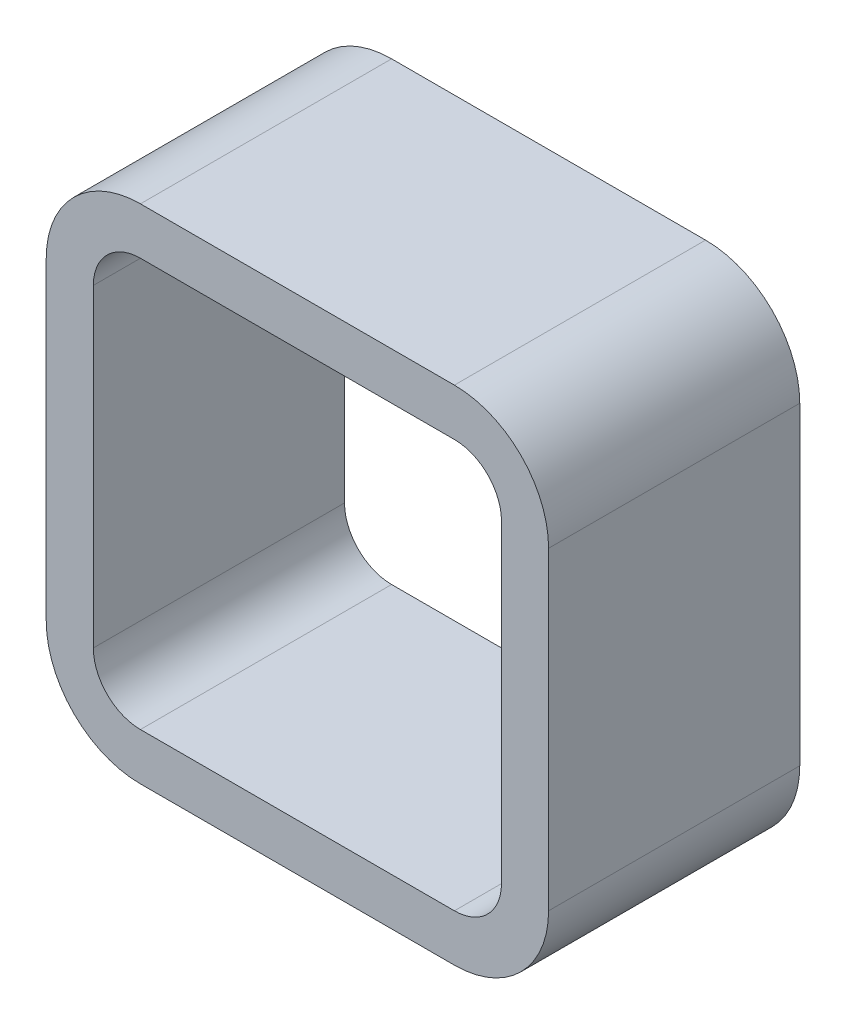
ISO-10303-21;
HEADER;
FILE_DESCRIPTION(('STEP AP214'),'2;1');
FILE_NAME('part.step','',(''),(''),'','','');
FILE_SCHEMA(('AUTOMOTIVE_DESIGN { 1 0 10303 214 1 1 1 1 }'));
ENDSEC;
DATA;
#1=APPLICATION_CONTEXT('core data for automotive mechanical design processes');
#2=APPLICATION_PROTOCOL_DEFINITION('international standard','automotive_design',2000,#1);
#3=PRODUCT_CONTEXT('',#1,'mechanical');
#4=PRODUCT('Part','Part','',(#3));
#5=PRODUCT_RELATED_PRODUCT_CATEGORY('part','',(#4));
#6=PRODUCT_DEFINITION_FORMATION('','',#4);
#7=PRODUCT_DEFINITION_CONTEXT('part definition',#1,'design');
#8=PRODUCT_DEFINITION('design','',#6,#7);
#9=PRODUCT_DEFINITION_SHAPE('','',#8);
#10=(LENGTH_UNIT() NAMED_UNIT(*) SI_UNIT(.MILLI.,.METRE.));
#11=(NAMED_UNIT(*) PLANE_ANGLE_UNIT() SI_UNIT($,.RADIAN.));
#12=(NAMED_UNIT(*) SI_UNIT($,.STERADIAN.) SOLID_ANGLE_UNIT());
#13=UNCERTAINTY_MEASURE_WITH_UNIT(LENGTH_MEASURE(1.E-05),#10,'distance_accuracy_value','');
#14=(GEOMETRIC_REPRESENTATION_CONTEXT(3) GLOBAL_UNCERTAINTY_ASSIGNED_CONTEXT((#13)) GLOBAL_UNIT_ASSIGNED_CONTEXT((#10,
#11,#12)) REPRESENTATION_CONTEXT('',''));
#15=CARTESIAN_POINT('',(0.,0.,0.));
#16=DIRECTION('',(0.,0.,1.));
#17=DIRECTION('',(1.,0.,0.));
#18=AXIS2_PLACEMENT_3D('',#15,#16,#17);
#19=CARTESIAN_POINT('',(41.27496425,41.27496425,12.7));
#20=DIRECTION('',(0.,0.,1.));
#21=DIRECTION('',(1.,0.,0.));
#22=AXIS2_PLACEMENT_3D('',#19,#20,#21);
#23=PLANE('',#22);
#24=CARTESIAN_POINT('',(41.27496425,41.27496425,12.7));
#25=DIRECTION('',(0.,0.,1.));
#26=DIRECTION('',(1.,0.,0.));
#27=AXIS2_PLACEMENT_3D('',#24,#25,#26);
#28=CIRCLE('',#27,9.52499175);
#29=CARTESIAN_POINT('',(50.799956,41.27496425,12.7));
#30=VERTEX_POINT('',#29);
#31=CARTESIAN_POINT('',(41.27496425,50.799956,12.7));
#32=VERTEX_POINT('',#31);
#33=EDGE_CURVE('E194',#30,#32,#28,.T.);
#34=ORIENTED_EDGE('',*,*,#33,.T.);
#35=DIRECTION('',(-1.,0.,0.));
#36=VECTOR('',#35,1.);
#37=CARTESIAN_POINT('',(41.27496425,50.799956,12.7));
#38=LINE('',#37,#36);
#39=CARTESIAN_POINT('',(9.52499174999999,50.799956,12.7));
#40=VERTEX_POINT('',#39);
#41=EDGE_CURVE('E197',#32,#40,#38,.T.);
#42=ORIENTED_EDGE('',*,*,#41,.T.);
#43=CARTESIAN_POINT('',(9.52499174999999,41.27496425,12.7));
#44=DIRECTION('',(0.,0.,1.));
#45=DIRECTION('',(1.,0.,0.));
#46=AXIS2_PLACEMENT_3D('',#43,#44,#45);
#47=CIRCLE('',#46,9.52499175);
#48=CARTESIAN_POINT('',(0.,41.27496425,12.7));
#49=VERTEX_POINT('',#48);
#50=EDGE_CURVE('E200',#40,#49,#47,.T.);
#51=ORIENTED_EDGE('',*,*,#50,.T.);
#52=DIRECTION('',(0.,-1.,0.));
#53=VECTOR('',#52,1.);
#54=CARTESIAN_POINT('',(0.,9.52499175,12.7));
#55=LINE('',#54,#53);
#56=CARTESIAN_POINT('',(0.,9.52499175,12.7));
#57=VERTEX_POINT('',#56);
#58=EDGE_CURVE('E202',#49,#57,#55,.T.);
#59=ORIENTED_EDGE('',*,*,#58,.T.);
#60=CARTESIAN_POINT('',(9.52499175,9.52499175,12.7));
#61=DIRECTION('',(0.,0.,1.));
#62=DIRECTION('',(1.,0.,0.));
#63=AXIS2_PLACEMENT_3D('',#60,#61,#62);
#64=CIRCLE('',#63,9.52499175);
#65=CARTESIAN_POINT('',(9.52499175,0.,12.7));
#66=VERTEX_POINT('',#65);
#67=EDGE_CURVE('E204',#57,#66,#64,.T.);
#68=ORIENTED_EDGE('',*,*,#67,.T.);
#69=DIRECTION('',(1.,0.,0.));
#70=VECTOR('',#69,1.);
#71=CARTESIAN_POINT('',(9.52499175,0.,12.7));
#72=LINE('',#71,#70);
#73=CARTESIAN_POINT('',(41.27496425,0.,12.7));
#74=VERTEX_POINT('',#73);
#75=EDGE_CURVE('E206',#66,#74,#72,.T.);
#76=ORIENTED_EDGE('',*,*,#75,.T.);
#77=CARTESIAN_POINT('',(41.27496425,9.52499175,12.7));
#78=DIRECTION('',(0.,0.,1.));
#79=DIRECTION('',(1.,0.,0.));
#80=AXIS2_PLACEMENT_3D('',#77,#78,#79);
#81=CIRCLE('',#80,9.52499175);
#82=CARTESIAN_POINT('',(50.799956,9.52499175,12.7));
#83=VERTEX_POINT('',#82);
#84=EDGE_CURVE('E208',#74,#83,#81,.T.);
#85=ORIENTED_EDGE('',*,*,#84,.T.);
#86=DIRECTION('',(0.,1.,0.));
#87=VECTOR('',#86,1.);
#88=CARTESIAN_POINT('',(50.799956,41.27496425,12.7));
#89=LINE('',#88,#87);
#90=EDGE_CURVE('E210',#83,#30,#89,.T.);
#91=ORIENTED_EDGE('',*,*,#90,.T.);
#92=EDGE_LOOP('',(#34,#42,#51,#59,#68,#76,#85,#91));
#93=FACE_BOUND('',#92,.T.);
#94=DIRECTION('',(0.,-1.,0.));
#95=VECTOR('',#94,1.);
#96=CARTESIAN_POINT('',(4.762495875,9.52499175,12.7));
#97=LINE('',#96,#95);
#98=CARTESIAN_POINT('',(4.76249587499999,41.27496425,12.7));
#99=VERTEX_POINT('',#98);
#100=CARTESIAN_POINT('',(4.762495875,9.52499175,12.7));
#101=VERTEX_POINT('',#100);
#102=EDGE_CURVE('E137',#99,#101,#97,.T.);
#103=ORIENTED_EDGE('',*,*,#102,.F.);
#104=CARTESIAN_POINT('',(9.52499174999999,41.27496425,12.7));
#105=DIRECTION('',(0.,0.,1.));
#106=DIRECTION('',(1.,0.,0.));
#107=AXIS2_PLACEMENT_3D('',#104,#105,#106);
#108=CIRCLE('',#107,4.762495875);
#109=CARTESIAN_POINT('',(9.52499174999999,46.037460125,12.7));
#110=VERTEX_POINT('',#109);
#111=EDGE_CURVE('E129',#110,#99,#108,.T.);
#112=ORIENTED_EDGE('',*,*,#111,.F.);
#113=DIRECTION('',(-1.,0.,0.));
#114=VECTOR('',#113,1.);
#115=CARTESIAN_POINT('',(41.27496425,46.037460125,12.7));
#116=LINE('',#115,#114);
#117=CARTESIAN_POINT('',(41.27496425,46.037460125,12.7));
#118=VERTEX_POINT('',#117);
#119=EDGE_CURVE('E162',#118,#110,#116,.T.);
#120=ORIENTED_EDGE('',*,*,#119,.F.);
#121=CARTESIAN_POINT('',(41.27496425,41.27496425,12.7));
#122=DIRECTION('',(0.,0.,1.));
#123=DIRECTION('',(1.,0.,0.));
#124=AXIS2_PLACEMENT_3D('',#121,#122,#123);
#125=CIRCLE('',#124,4.76249587500001);
#126=CARTESIAN_POINT('',(46.037460125,41.27496425,12.7));
#127=VERTEX_POINT('',#126);
#128=EDGE_CURVE('E160',#127,#118,#125,.T.);
#129=ORIENTED_EDGE('',*,*,#128,.F.);
#130=DIRECTION('',(0.,1.,0.));
#131=VECTOR('',#130,1.);
#132=CARTESIAN_POINT('',(46.037460125,41.27496425,12.7));
#133=LINE('',#132,#131);
#134=CARTESIAN_POINT('',(46.037460125,9.52499175,12.7));
#135=VERTEX_POINT('',#134);
#136=EDGE_CURVE('E158',#135,#127,#133,.T.);
#137=ORIENTED_EDGE('',*,*,#136,.F.);
#138=CARTESIAN_POINT('',(41.27496425,9.52499175,12.7));
#139=DIRECTION('',(0.,0.,1.));
#140=DIRECTION('',(1.,0.,0.));
#141=AXIS2_PLACEMENT_3D('',#138,#139,#140);
#142=CIRCLE('',#141,4.762495875);
#143=CARTESIAN_POINT('',(41.27496425,4.762495875,12.7));
#144=VERTEX_POINT('',#143);
#145=EDGE_CURVE('E156',#144,#135,#142,.T.);
#146=ORIENTED_EDGE('',*,*,#145,.F.);
#147=DIRECTION('',(1.,0.,0.));
#148=VECTOR('',#147,1.);
#149=CARTESIAN_POINT('',(9.52499175,4.762495875,12.7));
#150=LINE('',#149,#148);
#151=CARTESIAN_POINT('',(9.52499175,4.762495875,12.7));
#152=VERTEX_POINT('',#151);
#153=EDGE_CURVE('E152',#152,#144,#150,.T.);
#154=ORIENTED_EDGE('',*,*,#153,.F.);
#155=CARTESIAN_POINT('',(9.52499175,9.52499175,12.7));
#156=DIRECTION('',(0.,0.,1.));
#157=DIRECTION('',(1.,0.,0.));
#158=AXIS2_PLACEMENT_3D('',#155,#156,#157);
#159=CIRCLE('',#158,4.762495875);
#160=EDGE_CURVE('E150',#101,#152,#159,.T.);
#161=ORIENTED_EDGE('',*,*,#160,.F.);
#162=EDGE_LOOP('',(#103,#112,#120,#129,#137,#146,#154,#161));
#163=FACE_BOUND('',#162,.T.);
#164=ADVANCED_FACE('F16',(#93,#163),#23,.T.);
#165=CARTESIAN_POINT('',(41.27496425,41.27496425,-12.7));
#166=DIRECTION('',(0.,0.,1.));
#167=DIRECTION('',(1.,0.,0.));
#168=AXIS2_PLACEMENT_3D('',#165,#166,#167);
#169=PLANE('',#168);
#170=CARTESIAN_POINT('',(41.27496425,41.27496425,-12.7));
#171=DIRECTION('',(0.,0.,1.));
#172=DIRECTION('',(1.,0.,0.));
#173=AXIS2_PLACEMENT_3D('',#170,#171,#172);
#174=CIRCLE('',#173,9.52499175);
#175=CARTESIAN_POINT('',(50.799956,41.27496425,-12.7));
#176=VERTEX_POINT('',#175);
#177=CARTESIAN_POINT('',(41.27496425,50.799956,-12.7));
#178=VERTEX_POINT('',#177);
#179=EDGE_CURVE('E145',#176,#178,#174,.T.);
#180=ORIENTED_EDGE('',*,*,#179,.F.);
#181=DIRECTION('',(0.,1.,0.));
#182=VECTOR('',#181,1.);
#183=CARTESIAN_POINT('',(50.799956,41.27496425,-12.7));
#184=LINE('',#183,#182);
#185=CARTESIAN_POINT('',(50.799956,9.52499175,-12.7));
#186=VERTEX_POINT('',#185);
#187=EDGE_CURVE('E198',#186,#176,#184,.T.);
#188=ORIENTED_EDGE('',*,*,#187,.F.);
#189=CARTESIAN_POINT('',(41.27496425,9.52499175,-12.7));
#190=DIRECTION('',(0.,0.,1.));
#191=DIRECTION('',(1.,0.,0.));
#192=AXIS2_PLACEMENT_3D('',#189,#190,#191);
#193=CIRCLE('',#192,9.52499175);
#194=CARTESIAN_POINT('',(41.27496425,0.,-12.7));
#195=VERTEX_POINT('',#194);
#196=EDGE_CURVE('E225',#195,#186,#193,.T.);
#197=ORIENTED_EDGE('',*,*,#196,.F.);
#198=DIRECTION('',(1.,0.,0.));
#199=VECTOR('',#198,1.);
#200=CARTESIAN_POINT('',(9.52499175,0.,-12.7));
#201=LINE('',#200,#199);
#202=CARTESIAN_POINT('',(9.52499175,0.,-12.7));
#203=VERTEX_POINT('',#202);
#204=EDGE_CURVE('E223',#203,#195,#201,.T.);
#205=ORIENTED_EDGE('',*,*,#204,.F.);
#206=CARTESIAN_POINT('',(9.52499175,9.52499175,-12.7));
#207=DIRECTION('',(0.,0.,1.));
#208=DIRECTION('',(1.,0.,0.));
#209=AXIS2_PLACEMENT_3D('',#206,#207,#208);
#210=CIRCLE('',#209,9.52499175);
#211=CARTESIAN_POINT('',(0.,9.52499175,-12.7));
#212=VERTEX_POINT('',#211);
#213=EDGE_CURVE('E221',#212,#203,#210,.T.);
#214=ORIENTED_EDGE('',*,*,#213,.F.);
#215=DIRECTION('',(0.,-1.,0.));
#216=VECTOR('',#215,1.);
#217=CARTESIAN_POINT('',(0.,9.52499175,-12.7));
#218=LINE('',#217,#216);
#219=CARTESIAN_POINT('',(0.,41.27496425,-12.7));
#220=VERTEX_POINT('',#219);
#221=EDGE_CURVE('E219',#220,#212,#218,.T.);
#222=ORIENTED_EDGE('',*,*,#221,.F.);
#223=CARTESIAN_POINT('',(9.52499174999999,41.27496425,-12.7));
#224=DIRECTION('',(0.,0.,1.));
#225=DIRECTION('',(1.,0.,0.));
#226=AXIS2_PLACEMENT_3D('',#223,#224,#225);
#227=CIRCLE('',#226,9.52499175);
#228=CARTESIAN_POINT('',(9.52499174999999,50.799956,-12.7));
#229=VERTEX_POINT('',#228);
#230=EDGE_CURVE('E217',#229,#220,#227,.T.);
#231=ORIENTED_EDGE('',*,*,#230,.F.);
#232=DIRECTION('',(-1.,0.,0.));
#233=VECTOR('',#232,1.);
#234=CARTESIAN_POINT('',(41.27496425,50.799956,-12.7));
#235=LINE('',#234,#233);
#236=EDGE_CURVE('E215',#178,#229,#235,.T.);
#237=ORIENTED_EDGE('',*,*,#236,.F.);
#238=EDGE_LOOP('',(#180,#188,#197,#205,#214,#222,#231,#237));
#239=FACE_BOUND('',#238,.T.);
#240=CARTESIAN_POINT('',(9.52499174999999,41.27496425,-12.7));
#241=DIRECTION('',(0.,0.,1.));
#242=DIRECTION('',(1.,0.,0.));
#243=AXIS2_PLACEMENT_3D('',#240,#241,#242);
#244=CIRCLE('',#243,4.762495875);
#245=CARTESIAN_POINT('',(9.52499175,46.037460125,-12.7));
#246=VERTEX_POINT('',#245);
#247=CARTESIAN_POINT('',(4.76249587499999,41.27496425,-12.7));
#248=VERTEX_POINT('',#247);
#249=EDGE_CURVE('E39',#246,#248,#244,.T.);
#250=ORIENTED_EDGE('',*,*,#249,.T.);
#251=DIRECTION('',(0.,-1.,0.));
#252=VECTOR('',#251,1.);
#253=CARTESIAN_POINT('',(4.762495875,9.52499175,-12.7));
#254=LINE('',#253,#252);
#255=CARTESIAN_POINT('',(4.762495875,9.52499175,-12.7));
#256=VERTEX_POINT('',#255);
#257=EDGE_CURVE('E144',#248,#256,#254,.T.);
#258=ORIENTED_EDGE('',*,*,#257,.T.);
#259=CARTESIAN_POINT('',(9.52499175,9.52499175,-12.7));
#260=DIRECTION('',(0.,0.,1.));
#261=DIRECTION('',(1.,0.,0.));
#262=AXIS2_PLACEMENT_3D('',#259,#260,#261);
#263=CIRCLE('',#262,4.762495875);
#264=CARTESIAN_POINT('',(9.52499175,4.762495875,-12.7));
#265=VERTEX_POINT('',#264);
#266=EDGE_CURVE('E166',#256,#265,#263,.T.);
#267=ORIENTED_EDGE('',*,*,#266,.T.);
#268=DIRECTION('',(1.,0.,0.));
#269=VECTOR('',#268,1.);
#270=CARTESIAN_POINT('',(9.52499175,4.762495875,-12.7));
#271=LINE('',#270,#269);
#272=CARTESIAN_POINT('',(41.27496425,4.762495875,-12.7));
#273=VERTEX_POINT('',#272);
#274=EDGE_CURVE('E169',#265,#273,#271,.T.);
#275=ORIENTED_EDGE('',*,*,#274,.T.);
#276=CARTESIAN_POINT('',(41.27496425,9.52499175,-12.7));
#277=DIRECTION('',(0.,0.,1.));
#278=DIRECTION('',(1.,0.,0.));
#279=AXIS2_PLACEMENT_3D('',#276,#277,#278);
#280=CIRCLE('',#279,4.762495875);
#281=CARTESIAN_POINT('',(46.037460125,9.52499175,-12.7));
#282=VERTEX_POINT('',#281);
#283=EDGE_CURVE('E172',#273,#282,#280,.T.);
#284=ORIENTED_EDGE('',*,*,#283,.T.);
#285=DIRECTION('',(0.,1.,0.));
#286=VECTOR('',#285,1.);
#287=CARTESIAN_POINT('',(46.037460125,41.27496425,-12.7));
#288=LINE('',#287,#286);
#289=CARTESIAN_POINT('',(46.037460125,41.27496425,-12.7));
#290=VERTEX_POINT('',#289);
#291=EDGE_CURVE('E175',#282,#290,#288,.T.);
#292=ORIENTED_EDGE('',*,*,#291,.T.);
#293=CARTESIAN_POINT('',(41.27496425,41.27496425,-12.7));
#294=DIRECTION('',(0.,0.,1.));
#295=DIRECTION('',(1.,0.,0.));
#296=AXIS2_PLACEMENT_3D('',#293,#294,#295);
#297=CIRCLE('',#296,4.76249587500001);
#298=CARTESIAN_POINT('',(41.27496425,46.037460125,-12.7));
#299=VERTEX_POINT('',#298);
#300=EDGE_CURVE('E178',#290,#299,#297,.T.);
#301=ORIENTED_EDGE('',*,*,#300,.T.);
#302=DIRECTION('',(-1.,0.,0.));
#303=VECTOR('',#302,1.);
#304=CARTESIAN_POINT('',(41.27496425,46.037460125,-12.7));
#305=LINE('',#304,#303);
#306=EDGE_CURVE('E138',#299,#246,#305,.T.);
#307=ORIENTED_EDGE('',*,*,#306,.T.);
#308=EDGE_LOOP('',(#250,#258,#267,#275,#284,#292,#301,#307));
#309=FACE_BOUND('',#308,.T.);
#310=ADVANCED_FACE('F255',(#239,#309),#169,.F.);
#311=CARTESIAN_POINT('',(41.27496425,41.27496425,12.7));
#312=DIRECTION('',(0.,0.,-1.));
#313=DIRECTION('',(-1.,0.,0.));
#314=AXIS2_PLACEMENT_3D('',#311,#312,#313);
#315=CYLINDRICAL_SURFACE('',#314,9.52499175);
#316=ORIENTED_EDGE('',*,*,#179,.T.);
#317=DIRECTION('',(0.,0.,-1.));
#318=VECTOR('',#317,1.);
#319=CARTESIAN_POINT('',(41.27496425,50.799956,12.7));
#320=LINE('',#319,#318);
#321=EDGE_CURVE('E10',#32,#178,#320,.T.);
#322=ORIENTED_EDGE('',*,*,#321,.F.);
#323=ORIENTED_EDGE('',*,*,#33,.F.);
#324=DIRECTION('',(0.,0.,-1.));
#325=VECTOR('',#324,1.);
#326=CARTESIAN_POINT('',(50.799956,41.27496425,12.7));
#327=LINE('',#326,#325);
#328=EDGE_CURVE('E212',#30,#176,#327,.T.);
#329=ORIENTED_EDGE('',*,*,#328,.T.);
#330=EDGE_LOOP('',(#316,#322,#323,#329));
#331=FACE_BOUND('',#330,.T.);
#332=ADVANCED_FACE('F18',(#331),#315,.T.);
#333=CARTESIAN_POINT('',(41.27496425,50.799956,12.7));
#334=DIRECTION('',(0.,-1.,0.));
#335=DIRECTION('',(0.,0.,-1.));
#336=AXIS2_PLACEMENT_3D('',#333,#334,#335);
#337=PLANE('',#336);
#338=ORIENTED_EDGE('',*,*,#236,.T.);
#339=DIRECTION('',(0.,0.,-1.));
#340=VECTOR('',#339,1.);
#341=CARTESIAN_POINT('',(9.52499174999999,50.799956,12.7));
#342=LINE('',#341,#340);
#343=EDGE_CURVE('E24',#40,#229,#342,.T.);
#344=ORIENTED_EDGE('',*,*,#343,.F.);
#345=ORIENTED_EDGE('',*,*,#41,.F.);
#346=ORIENTED_EDGE('',*,*,#321,.T.);
#347=EDGE_LOOP('',(#338,#344,#345,#346));
#348=FACE_BOUND('',#347,.T.);
#349=ADVANCED_FACE('F272',(#348),#337,.F.);
#350=CARTESIAN_POINT('',(9.52499174999999,41.27496425,12.7));
#351=DIRECTION('',(0.,0.,-1.));
#352=DIRECTION('',(-1.,0.,0.));
#353=AXIS2_PLACEMENT_3D('',#350,#351,#352);
#354=CYLINDRICAL_SURFACE('',#353,9.52499175);
#355=ORIENTED_EDGE('',*,*,#230,.T.);
#356=DIRECTION('',(0.,0.,-1.));
#357=VECTOR('',#356,1.);
#358=CARTESIAN_POINT('',(0.,41.27496425,12.7));
#359=LINE('',#358,#357);
#360=EDGE_CURVE('E242',#49,#220,#359,.T.);
#361=ORIENTED_EDGE('',*,*,#360,.F.);
#362=ORIENTED_EDGE('',*,*,#50,.F.);
#363=ORIENTED_EDGE('',*,*,#343,.T.);
#364=EDGE_LOOP('',(#355,#361,#362,#363));
#365=FACE_BOUND('',#364,.T.);
#366=ADVANCED_FACE('F249',(#365),#354,.T.);
#367=CARTESIAN_POINT('',(0.,9.52499175,12.7));
#368=DIRECTION('',(1.,0.,0.));
#369=DIRECTION('',(0.,1.,0.));
#370=AXIS2_PLACEMENT_3D('',#367,#368,#369);
#371=PLANE('',#370);
#372=ORIENTED_EDGE('',*,*,#221,.T.);
#373=DIRECTION('',(0.,0.,-1.));
#374=VECTOR('',#373,1.);
#375=CARTESIAN_POINT('',(0.,9.52499175,12.7));
#376=LINE('',#375,#374);
#377=EDGE_CURVE('E239',#57,#212,#376,.T.);
#378=ORIENTED_EDGE('',*,*,#377,.F.);
#379=ORIENTED_EDGE('',*,*,#58,.F.);
#380=ORIENTED_EDGE('',*,*,#360,.T.);
#381=EDGE_LOOP('',(#372,#378,#379,#380));
#382=FACE_BOUND('',#381,.T.);
#383=ADVANCED_FACE('F261',(#382),#371,.F.);
#384=CARTESIAN_POINT('',(9.52499175,9.52499175,12.7));
#385=DIRECTION('',(0.,0.,-1.));
#386=DIRECTION('',(-1.,0.,0.));
#387=AXIS2_PLACEMENT_3D('',#384,#385,#386);
#388=CYLINDRICAL_SURFACE('',#387,9.52499175);
#389=ORIENTED_EDGE('',*,*,#213,.T.);
#390=DIRECTION('',(0.,0.,-1.));
#391=VECTOR('',#390,1.);
#392=CARTESIAN_POINT('',(9.52499175,0.,12.7));
#393=LINE('',#392,#391);
#394=EDGE_CURVE('E236',#66,#203,#393,.T.);
#395=ORIENTED_EDGE('',*,*,#394,.F.);
#396=ORIENTED_EDGE('',*,*,#67,.F.);
#397=ORIENTED_EDGE('',*,*,#377,.T.);
#398=EDGE_LOOP('',(#389,#395,#396,#397));
#399=FACE_BOUND('',#398,.T.);
#400=ADVANCED_FACE('F265',(#399),#388,.T.);
#401=CARTESIAN_POINT('',(9.52499175,0.,12.7));
#402=DIRECTION('',(0.,1.,0.));
#403=DIRECTION('',(0.,0.,1.));
#404=AXIS2_PLACEMENT_3D('',#401,#402,#403);
#405=PLANE('',#404);
#406=ORIENTED_EDGE('',*,*,#204,.T.);
#407=DIRECTION('',(0.,0.,-1.));
#408=VECTOR('',#407,1.);
#409=CARTESIAN_POINT('',(41.27496425,0.,12.7));
#410=LINE('',#409,#408);
#411=EDGE_CURVE('E233',#74,#195,#410,.T.);
#412=ORIENTED_EDGE('',*,*,#411,.F.);
#413=ORIENTED_EDGE('',*,*,#75,.F.);
#414=ORIENTED_EDGE('',*,*,#394,.T.);
#415=EDGE_LOOP('',(#406,#412,#413,#414));
#416=FACE_BOUND('',#415,.T.);
#417=ADVANCED_FACE('F285',(#416),#405,.F.);
#418=CARTESIAN_POINT('',(41.27496425,9.52499175,12.7));
#419=DIRECTION('',(0.,0.,-1.));
#420=DIRECTION('',(-1.,0.,0.));
#421=AXIS2_PLACEMENT_3D('',#418,#419,#420);
#422=CYLINDRICAL_SURFACE('',#421,9.52499175);
#423=ORIENTED_EDGE('',*,*,#196,.T.);
#424=DIRECTION('',(0.,0.,-1.));
#425=VECTOR('',#424,1.);
#426=CARTESIAN_POINT('',(50.799956,9.52499175,12.7));
#427=LINE('',#426,#425);
#428=EDGE_CURVE('E230',#83,#186,#427,.T.);
#429=ORIENTED_EDGE('',*,*,#428,.F.);
#430=ORIENTED_EDGE('',*,*,#84,.F.);
#431=ORIENTED_EDGE('',*,*,#411,.T.);
#432=EDGE_LOOP('',(#423,#429,#430,#431));
#433=FACE_BOUND('',#432,.T.);
#434=ADVANCED_FACE('F283',(#433),#422,.T.);
#435=CARTESIAN_POINT('',(50.799956,41.27496425,12.7));
#436=DIRECTION('',(-1.,0.,0.));
#437=DIRECTION('',(0.,-1.,0.));
#438=AXIS2_PLACEMENT_3D('',#435,#436,#437);
#439=PLANE('',#438);
#440=ORIENTED_EDGE('',*,*,#187,.T.);
#441=ORIENTED_EDGE('',*,*,#328,.F.);
#442=ORIENTED_EDGE('',*,*,#90,.F.);
#443=ORIENTED_EDGE('',*,*,#428,.T.);
#444=EDGE_LOOP('',(#440,#441,#442,#443));
#445=FACE_BOUND('',#444,.T.);
#446=ADVANCED_FACE('F278',(#445),#439,.F.);
#447=CARTESIAN_POINT('',(9.52499174999999,41.27496425,12.7));
#448=DIRECTION('',(0.,0.,-1.));
#449=DIRECTION('',(-1.,0.,0.));
#450=AXIS2_PLACEMENT_3D('',#447,#448,#449);
#451=CYLINDRICAL_SURFACE('',#450,4.762495875);
#452=ORIENTED_EDGE('',*,*,#249,.F.);
#453=DIRECTION('',(0.,0.,-1.));
#454=VECTOR('',#453,1.);
#455=CARTESIAN_POINT('',(9.52499174999999,46.037460125,12.7));
#456=LINE('',#455,#454);
#457=EDGE_CURVE('E133',#110,#246,#456,.T.);
#458=ORIENTED_EDGE('',*,*,#457,.F.);
#459=ORIENTED_EDGE('',*,*,#111,.T.);
#460=DIRECTION('',(0.,0.,-1.));
#461=VECTOR('',#460,1.);
#462=CARTESIAN_POINT('',(4.76249587499999,41.27496425,12.7));
#463=LINE('',#462,#461);
#464=EDGE_CURVE('E132',#99,#248,#463,.T.);
#465=ORIENTED_EDGE('',*,*,#464,.T.);
#466=EDGE_LOOP('',(#452,#458,#459,#465));
#467=FACE_BOUND('',#466,.T.);
#468=ADVANCED_FACE('F131',(#467),#451,.F.);
#469=CARTESIAN_POINT('',(4.762495875,9.52499175,12.7));
#470=DIRECTION('',(1.,0.,0.));
#471=DIRECTION('',(0.,1.,0.));
#472=AXIS2_PLACEMENT_3D('',#469,#470,#471);
#473=PLANE('',#472);
#474=ORIENTED_EDGE('',*,*,#257,.F.);
#475=ORIENTED_EDGE('',*,*,#464,.F.);
#476=ORIENTED_EDGE('',*,*,#102,.T.);
#477=DIRECTION('',(0.,0.,-1.));
#478=VECTOR('',#477,1.);
#479=CARTESIAN_POINT('',(4.762495875,9.52499175,12.7));
#480=LINE('',#479,#478);
#481=EDGE_CURVE('E146',#101,#256,#480,.T.);
#482=ORIENTED_EDGE('',*,*,#481,.T.);
#483=EDGE_LOOP('',(#474,#475,#476,#482));
#484=FACE_BOUND('',#483,.T.);
#485=ADVANCED_FACE('F141',(#484),#473,.T.);
#486=CARTESIAN_POINT('',(9.52499175,9.52499175,12.7));
#487=DIRECTION('',(0.,0.,-1.));
#488=DIRECTION('',(-1.,0.,0.));
#489=AXIS2_PLACEMENT_3D('',#486,#487,#488);
#490=CYLINDRICAL_SURFACE('',#489,4.762495875);
#491=ORIENTED_EDGE('',*,*,#266,.F.);
#492=ORIENTED_EDGE('',*,*,#481,.F.);
#493=ORIENTED_EDGE('',*,*,#160,.T.);
#494=DIRECTION('',(0.,0.,-1.));
#495=VECTOR('',#494,1.);
#496=CARTESIAN_POINT('',(9.52499175,4.762495875,12.7));
#497=LINE('',#496,#495);
#498=EDGE_CURVE('E191',#152,#265,#497,.T.);
#499=ORIENTED_EDGE('',*,*,#498,.T.);
#500=EDGE_LOOP('',(#491,#492,#493,#499));
#501=FACE_BOUND('',#500,.T.);
#502=ADVANCED_FACE('F315',(#501),#490,.F.);
#503=CARTESIAN_POINT('',(9.52499175,4.762495875,12.7));
#504=DIRECTION('',(0.,1.,0.));
#505=DIRECTION('',(0.,0.,1.));
#506=AXIS2_PLACEMENT_3D('',#503,#504,#505);
#507=PLANE('',#506);
#508=ORIENTED_EDGE('',*,*,#274,.F.);
#509=ORIENTED_EDGE('',*,*,#498,.F.);
#510=ORIENTED_EDGE('',*,*,#153,.T.);
#511=DIRECTION('',(0.,0.,-1.));
#512=VECTOR('',#511,1.);
#513=CARTESIAN_POINT('',(41.27496425,4.762495875,12.7));
#514=LINE('',#513,#512);
#515=EDGE_CURVE('E189',#144,#273,#514,.T.);
#516=ORIENTED_EDGE('',*,*,#515,.T.);
#517=EDGE_LOOP('',(#508,#509,#510,#516));
#518=FACE_BOUND('',#517,.T.);
#519=ADVANCED_FACE('F320',(#518),#507,.T.);
#520=CARTESIAN_POINT('',(41.27496425,9.52499175,12.7));
#521=DIRECTION('',(0.,0.,-1.));
#522=DIRECTION('',(-1.,0.,0.));
#523=AXIS2_PLACEMENT_3D('',#520,#521,#522);
#524=CYLINDRICAL_SURFACE('',#523,4.762495875);
#525=ORIENTED_EDGE('',*,*,#283,.F.);
#526=ORIENTED_EDGE('',*,*,#515,.F.);
#527=ORIENTED_EDGE('',*,*,#145,.T.);
#528=DIRECTION('',(0.,0.,-1.));
#529=VECTOR('',#528,1.);
#530=CARTESIAN_POINT('',(46.037460125,9.52499175,12.7));
#531=LINE('',#530,#529);
#532=EDGE_CURVE('E187',#135,#282,#531,.T.);
#533=ORIENTED_EDGE('',*,*,#532,.T.);
#534=EDGE_LOOP('',(#525,#526,#527,#533));
#535=FACE_BOUND('',#534,.T.);
#536=ADVANCED_FACE('F326',(#535),#524,.F.);
#537=CARTESIAN_POINT('',(46.037460125,41.27496425,12.7));
#538=DIRECTION('',(-1.,0.,0.));
#539=DIRECTION('',(0.,-1.,0.));
#540=AXIS2_PLACEMENT_3D('',#537,#538,#539);
#541=PLANE('',#540);
#542=ORIENTED_EDGE('',*,*,#291,.F.);
#543=ORIENTED_EDGE('',*,*,#532,.F.);
#544=ORIENTED_EDGE('',*,*,#136,.T.);
#545=DIRECTION('',(0.,0.,-1.));
#546=VECTOR('',#545,1.);
#547=CARTESIAN_POINT('',(46.037460125,41.27496425,12.7));
#548=LINE('',#547,#546);
#549=EDGE_CURVE('E185',#127,#290,#548,.T.);
#550=ORIENTED_EDGE('',*,*,#549,.T.);
#551=EDGE_LOOP('',(#542,#543,#544,#550));
#552=FACE_BOUND('',#551,.T.);
#553=ADVANCED_FACE('F330',(#552),#541,.T.);
#554=CARTESIAN_POINT('',(41.27496425,41.27496425,12.7));
#555=DIRECTION('',(0.,0.,-1.));
#556=DIRECTION('',(-1.,0.,0.));
#557=AXIS2_PLACEMENT_3D('',#554,#555,#556);
#558=CYLINDRICAL_SURFACE('',#557,4.76249587500001);
#559=ORIENTED_EDGE('',*,*,#300,.F.);
#560=ORIENTED_EDGE('',*,*,#549,.F.);
#561=ORIENTED_EDGE('',*,*,#128,.T.);
#562=DIRECTION('',(0.,0.,-1.));
#563=VECTOR('',#562,1.);
#564=CARTESIAN_POINT('',(41.27496425,46.037460125,12.7));
#565=LINE('',#564,#563);
#566=EDGE_CURVE('E31',#118,#299,#565,.T.);
#567=ORIENTED_EDGE('',*,*,#566,.T.);
#568=EDGE_LOOP('',(#559,#560,#561,#567));
#569=FACE_BOUND('',#568,.T.);
#570=ADVANCED_FACE('F334',(#569),#558,.F.);
#571=CARTESIAN_POINT('',(41.27496425,46.037460125,12.7));
#572=DIRECTION('',(0.,-1.,0.));
#573=DIRECTION('',(1.,0.,0.));
#574=AXIS2_PLACEMENT_3D('',#571,#572,#573);
#575=PLANE('',#574);
#576=ORIENTED_EDGE('',*,*,#306,.F.);
#577=ORIENTED_EDGE('',*,*,#566,.F.);
#578=ORIENTED_EDGE('',*,*,#119,.T.);
#579=ORIENTED_EDGE('',*,*,#457,.T.);
#580=EDGE_LOOP('',(#576,#577,#578,#579));
#581=FACE_BOUND('',#580,.T.);
#582=ADVANCED_FACE('F338',(#581),#575,.T.);
#583=CLOSED_SHELL('',(#164,#310,#332,#349,#366,#383,#400,#417,#434,#446,#468,#485,#502,#519,
#536,#553,#570,#582));
#584=MANIFOLD_SOLID_BREP('B1',#583);
#585=ADVANCED_BREP_SHAPE_REPRESENTATION('',(#18,#584),#14);
#586=SHAPE_DEFINITION_REPRESENTATION(#9,#585);
ENDSEC;
END-ISO-10303-21;
